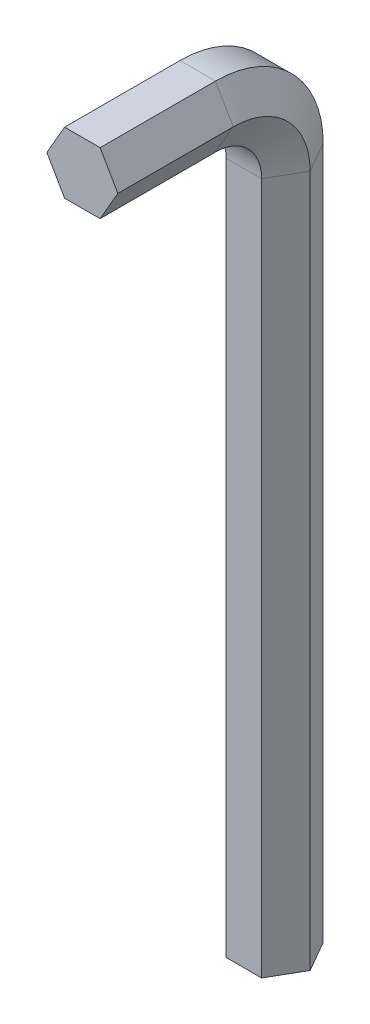
ISO-10303-21;
HEADER;
FILE_DESCRIPTION(('STEP AP214'),'2;1');
FILE_NAME('part.step','',(''),(''),'','','');
FILE_SCHEMA(('AUTOMOTIVE_DESIGN { 1 0 10303 214 1 1 1 1 }'));
ENDSEC;
DATA;
#1=APPLICATION_CONTEXT('core data for automotive mechanical design processes');
#2=APPLICATION_PROTOCOL_DEFINITION('international standard','automotive_design',2000,#1);
#3=PRODUCT_CONTEXT('',#1,'mechanical');
#4=PRODUCT('Part','Part','',(#3));
#5=PRODUCT_RELATED_PRODUCT_CATEGORY('part','',(#4));
#6=PRODUCT_DEFINITION_FORMATION('','',#4);
#7=PRODUCT_DEFINITION_CONTEXT('part definition',#1,'design');
#8=PRODUCT_DEFINITION('design','',#6,#7);
#9=PRODUCT_DEFINITION_SHAPE('','',#8);
#10=(LENGTH_UNIT() NAMED_UNIT(*) SI_UNIT(.MILLI.,.METRE.));
#11=(NAMED_UNIT(*) PLANE_ANGLE_UNIT() SI_UNIT($,.RADIAN.));
#12=(NAMED_UNIT(*) SI_UNIT($,.STERADIAN.) SOLID_ANGLE_UNIT());
#13=UNCERTAINTY_MEASURE_WITH_UNIT(LENGTH_MEASURE(1.E-05),#10,'distance_accuracy_value','');
#14=(GEOMETRIC_REPRESENTATION_CONTEXT(3) GLOBAL_UNCERTAINTY_ASSIGNED_CONTEXT((#13)) GLOBAL_UNIT_ASSIGNED_CONTEXT((#10,
#11,#12)) REPRESENTATION_CONTEXT('',''));
#15=CARTESIAN_POINT('',(0.,0.,0.));
#16=DIRECTION('',(0.,0.,1.));
#17=DIRECTION('',(1.,0.,0.));
#18=AXIS2_PLACEMENT_3D('',#15,#16,#17);
#19=CARTESIAN_POINT('',(0.,0.,0.));
#20=DIRECTION('',(0.,1.,0.));
#21=DIRECTION('',(0.,0.,1.));
#22=AXIS2_PLACEMENT_3D('',#19,#20,#21);
#23=PLANE('',#22);
#24=DIRECTION('',(1.,0.,0.));
#25=VECTOR('',#24,1.);
#26=CARTESIAN_POINT('',(-2.3094010767585,0.,4.));
#27=LINE('',#26,#25);
#28=CARTESIAN_POINT('',(-2.3094010767585,0.,4.));
#29=VERTEX_POINT('',#28);
#30=CARTESIAN_POINT('',(2.3094010767585,0.,4.));
#31=VERTEX_POINT('',#30);
#32=EDGE_CURVE('E184',#29,#31,#27,.T.);
#33=ORIENTED_EDGE('',*,*,#32,.F.);
#34=DIRECTION('',(0.5,0.,0.866025403784439));
#35=VECTOR('',#34,1.);
#36=CARTESIAN_POINT('',(-4.618802153517,0.,0.));
#37=LINE('',#36,#35);
#38=CARTESIAN_POINT('',(-4.618802153517,0.,0.));
#39=VERTEX_POINT('',#38);
#40=EDGE_CURVE('E226',#39,#29,#37,.T.);
#41=ORIENTED_EDGE('',*,*,#40,.F.);
#42=DIRECTION('',(-0.5,0.,0.866025403784439));
#43=VECTOR('',#42,1.);
#44=CARTESIAN_POINT('',(-2.3094010767585,0.,-4.));
#45=LINE('',#44,#43);
#46=CARTESIAN_POINT('',(-2.3094010767585,0.,-4.));
#47=VERTEX_POINT('',#46);
#48=EDGE_CURVE('E213',#47,#39,#45,.T.);
#49=ORIENTED_EDGE('',*,*,#48,.F.);
#50=DIRECTION('',(-1.,0.,0.));
#51=VECTOR('',#50,1.);
#52=CARTESIAN_POINT('',(2.3094010767585,0.,-4.));
#53=LINE('',#52,#51);
#54=CARTESIAN_POINT('',(2.3094010767585,0.,-4.));
#55=VERTEX_POINT('',#54);
#56=EDGE_CURVE('E136',#55,#47,#53,.T.);
#57=ORIENTED_EDGE('',*,*,#56,.F.);
#58=DIRECTION('',(-0.5,0.,-0.866025403784438));
#59=VECTOR('',#58,1.);
#60=CARTESIAN_POINT('',(4.61880215351701,0.,0.));
#61=LINE('',#60,#59);
#62=CARTESIAN_POINT('',(4.61880215351701,0.,0.));
#63=VERTEX_POINT('',#62);
#64=EDGE_CURVE('E140',#63,#55,#61,.T.);
#65=ORIENTED_EDGE('',*,*,#64,.F.);
#66=DIRECTION('',(0.5,0.,-0.866025403784439));
#67=VECTOR('',#66,1.);
#68=CARTESIAN_POINT('',(2.3094010767585,0.,4.));
#69=LINE('',#68,#67);
#70=EDGE_CURVE('E145',#31,#63,#69,.T.);
#71=ORIENTED_EDGE('',*,*,#70,.F.);
#72=EDGE_LOOP('',(#33,#41,#49,#57,#65,#71));
#73=FACE_BOUND('',#72,.T.);
#74=ADVANCED_FACE('F35',(#73),#23,.F.);
#75=CARTESIAN_POINT('',(0.,100.,25.));
#76=DIRECTION('',(0.,0.,1.));
#77=DIRECTION('',(0.,-1.,0.));
#78=AXIS2_PLACEMENT_3D('',#75,#76,#77);
#79=PLANE('',#78);
#80=DIRECTION('',(1.,0.,0.));
#81=VECTOR('',#80,1.);
#82=CARTESIAN_POINT('',(-2.3094010767585,96.,25.));
#83=LINE('',#82,#81);
#84=CARTESIAN_POINT('',(-2.3094010767585,96.,25.));
#85=VERTEX_POINT('',#84);
#86=CARTESIAN_POINT('',(2.3094010767585,96.,25.));
#87=VERTEX_POINT('',#86);
#88=EDGE_CURVE('E156',#85,#87,#83,.T.);
#89=ORIENTED_EDGE('',*,*,#88,.T.);
#90=DIRECTION('',(0.5,0.866025403784439,0.));
#91=VECTOR('',#90,1.);
#92=CARTESIAN_POINT('',(2.3094010767585,96.,25.));
#93=LINE('',#92,#91);
#94=CARTESIAN_POINT('',(4.61880215351701,100.,25.));
#95=VERTEX_POINT('',#94);
#96=EDGE_CURVE('E159',#87,#95,#93,.T.);
#97=ORIENTED_EDGE('',*,*,#96,.T.);
#98=DIRECTION('',(-0.5,0.866025403784438,0.));
#99=VECTOR('',#98,1.);
#100=CARTESIAN_POINT('',(4.61880215351701,100.,25.));
#101=LINE('',#100,#99);
#102=CARTESIAN_POINT('',(2.3094010767585,104.,25.));
#103=VERTEX_POINT('',#102);
#104=EDGE_CURVE('E199',#95,#103,#101,.T.);
#105=ORIENTED_EDGE('',*,*,#104,.T.);
#106=DIRECTION('',(-1.,0.,0.));
#107=VECTOR('',#106,1.);
#108=CARTESIAN_POINT('',(2.3094010767585,104.,25.));
#109=LINE('',#108,#107);
#110=CARTESIAN_POINT('',(-2.3094010767585,104.,25.));
#111=VERTEX_POINT('',#110);
#112=EDGE_CURVE('E54',#103,#111,#109,.T.);
#113=ORIENTED_EDGE('',*,*,#112,.T.);
#114=DIRECTION('',(-0.5,-0.866025403784439,0.));
#115=VECTOR('',#114,1.);
#116=CARTESIAN_POINT('',(-2.3094010767585,104.,25.));
#117=LINE('',#116,#115);
#118=CARTESIAN_POINT('',(-4.618802153517,100.,25.));
#119=VERTEX_POINT('',#118);
#120=EDGE_CURVE('E48',#111,#119,#117,.T.);
#121=ORIENTED_EDGE('',*,*,#120,.T.);
#122=DIRECTION('',(0.5,-0.866025403784439,0.));
#123=VECTOR('',#122,1.);
#124=CARTESIAN_POINT('',(-4.618802153517,100.,25.));
#125=LINE('',#124,#123);
#126=EDGE_CURVE('E11',#119,#85,#125,.T.);
#127=ORIENTED_EDGE('',*,*,#126,.T.);
#128=EDGE_LOOP('',(#89,#97,#105,#113,#121,#127));
#129=FACE_BOUND('',#128,.T.);
#130=ADVANCED_FACE('F158',(#129),#79,.T.);
#131=CARTESIAN_POINT('',(-2.3094010767585,0.,4.));
#132=DIRECTION('',(0.,0.,1.));
#133=DIRECTION('',(0.,-1.,0.));
#134=AXIS2_PLACEMENT_3D('',#131,#132,#133);
#135=PLANE('',#134);
#136=DIRECTION('',(0.,1.,0.));
#137=VECTOR('',#136,1.);
#138=CARTESIAN_POINT('',(2.3094010767585,0.,4.));
#139=LINE('',#138,#137);
#140=CARTESIAN_POINT('',(2.3094010767585,90.,4.));
#141=VERTEX_POINT('',#140);
#142=EDGE_CURVE('E189',#31,#141,#139,.T.);
#143=ORIENTED_EDGE('',*,*,#142,.T.);
#144=DIRECTION('',(1.,0.,0.));
#145=VECTOR('',#144,1.);
#146=CARTESIAN_POINT('',(-2.3094010767585,90.,4.));
#147=LINE('',#146,#145);
#148=CARTESIAN_POINT('',(-2.3094010767585,90.,4.));
#149=VERTEX_POINT('',#148);
#150=EDGE_CURVE('E258',#149,#141,#147,.T.);
#151=ORIENTED_EDGE('',*,*,#150,.F.);
#152=DIRECTION('',(0.,1.,0.));
#153=VECTOR('',#152,1.);
#154=CARTESIAN_POINT('',(-2.3094010767585,0.,4.));
#155=LINE('',#154,#153);
#156=EDGE_CURVE('E240',#29,#149,#155,.T.);
#157=ORIENTED_EDGE('',*,*,#156,.F.);
#158=ORIENTED_EDGE('',*,*,#32,.T.);
#159=EDGE_LOOP('',(#143,#151,#157,#158));
#160=FACE_BOUND('',#159,.T.);
#161=ADVANCED_FACE('F265',(#160),#135,.T.);
#162=CARTESIAN_POINT('',(2.3094010767585,0.,4.));
#163=DIRECTION('',(0.866025403784439,0.,0.5));
#164=DIRECTION('',(0.5,0.,-0.866025403784439));
#165=AXIS2_PLACEMENT_3D('',#162,#163,#164);
#166=PLANE('',#165);
#167=DIRECTION('',(0.,1.,0.));
#168=VECTOR('',#167,1.);
#169=CARTESIAN_POINT('',(4.61880215351701,0.,0.));
#170=LINE('',#169,#168);
#171=CARTESIAN_POINT('',(4.61880215351701,90.,0.));
#172=VERTEX_POINT('',#171);
#173=EDGE_CURVE('E188',#63,#172,#170,.T.);
#174=ORIENTED_EDGE('',*,*,#173,.T.);
#175=DIRECTION('',(0.5,0.,-0.866025403784439));
#176=VECTOR('',#175,1.);
#177=CARTESIAN_POINT('',(2.3094010767585,90.,4.));
#178=LINE('',#177,#176);
#179=EDGE_CURVE('E185',#141,#172,#178,.T.);
#180=ORIENTED_EDGE('',*,*,#179,.F.);
#181=ORIENTED_EDGE('',*,*,#142,.F.);
#182=ORIENTED_EDGE('',*,*,#70,.T.);
#183=EDGE_LOOP('',(#174,#180,#181,#182));
#184=FACE_BOUND('',#183,.T.);
#185=ADVANCED_FACE('F268',(#184),#166,.T.);
#186=CARTESIAN_POINT('',(4.61880215351701,0.,0.));
#187=DIRECTION('',(0.866025403784438,0.,-0.5));
#188=DIRECTION('',(-0.5,0.,-0.866025403784439));
#189=AXIS2_PLACEMENT_3D('',#186,#187,#188);
#190=PLANE('',#189);
#191=DIRECTION('',(0.,1.,0.));
#192=VECTOR('',#191,1.);
#193=CARTESIAN_POINT('',(2.3094010767585,0.,-4.));
#194=LINE('',#193,#192);
#195=CARTESIAN_POINT('',(2.3094010767585,90.,-4.));
#196=VERTEX_POINT('',#195);
#197=EDGE_CURVE('E202',#55,#196,#194,.T.);
#198=ORIENTED_EDGE('',*,*,#197,.T.);
#199=DIRECTION('',(-0.5,0.,-0.866025403784438));
#200=VECTOR('',#199,1.);
#201=CARTESIAN_POINT('',(4.61880215351701,90.,0.));
#202=LINE('',#201,#200);
#203=EDGE_CURVE('E192',#172,#196,#202,.T.);
#204=ORIENTED_EDGE('',*,*,#203,.F.);
#205=ORIENTED_EDGE('',*,*,#173,.F.);
#206=ORIENTED_EDGE('',*,*,#64,.T.);
#207=EDGE_LOOP('',(#198,#204,#205,#206));
#208=FACE_BOUND('',#207,.T.);
#209=ADVANCED_FACE('F322',(#208),#190,.T.);
#210=CARTESIAN_POINT('',(2.3094010767585,0.,-4.));
#211=DIRECTION('',(0.,0.,-1.));
#212=DIRECTION('',(0.,1.,0.));
#213=AXIS2_PLACEMENT_3D('',#210,#211,#212);
#214=PLANE('',#213);
#215=DIRECTION('',(0.,1.,0.));
#216=VECTOR('',#215,1.);
#217=CARTESIAN_POINT('',(-2.3094010767585,0.,-4.));
#218=LINE('',#217,#216);
#219=CARTESIAN_POINT('',(-2.3094010767585,90.,-4.));
#220=VERTEX_POINT('',#219);
#221=EDGE_CURVE('E215',#47,#220,#218,.T.);
#222=ORIENTED_EDGE('',*,*,#221,.T.);
#223=DIRECTION('',(-1.,0.,0.));
#224=VECTOR('',#223,1.);
#225=CARTESIAN_POINT('',(2.3094010767585,90.,-4.));
#226=LINE('',#225,#224);
#227=EDGE_CURVE('E205',#196,#220,#226,.T.);
#228=ORIENTED_EDGE('',*,*,#227,.F.);
#229=ORIENTED_EDGE('',*,*,#197,.F.);
#230=ORIENTED_EDGE('',*,*,#56,.T.);
#231=EDGE_LOOP('',(#222,#228,#229,#230));
#232=FACE_BOUND('',#231,.T.);
#233=ADVANCED_FACE('F330',(#232),#214,.T.);
#234=CARTESIAN_POINT('',(-2.3094010767585,0.,-4.));
#235=DIRECTION('',(-0.866025403784439,0.,-0.5));
#236=DIRECTION('',(-0.5,0.,0.866025403784439));
#237=AXIS2_PLACEMENT_3D('',#234,#235,#236);
#238=PLANE('',#237);
#239=DIRECTION('',(0.,1.,0.));
#240=VECTOR('',#239,1.);
#241=CARTESIAN_POINT('',(-4.618802153517,0.,0.));
#242=LINE('',#241,#240);
#243=CARTESIAN_POINT('',(-4.618802153517,90.,0.));
#244=VERTEX_POINT('',#243);
#245=EDGE_CURVE('E228',#39,#244,#242,.T.);
#246=ORIENTED_EDGE('',*,*,#245,.T.);
#247=DIRECTION('',(-0.5,0.,0.866025403784439));
#248=VECTOR('',#247,1.);
#249=CARTESIAN_POINT('',(-2.3094010767585,90.,-4.));
#250=LINE('',#249,#248);
#251=EDGE_CURVE('E218',#220,#244,#250,.T.);
#252=ORIENTED_EDGE('',*,*,#251,.F.);
#253=ORIENTED_EDGE('',*,*,#221,.F.);
#254=ORIENTED_EDGE('',*,*,#48,.T.);
#255=EDGE_LOOP('',(#246,#252,#253,#254));
#256=FACE_BOUND('',#255,.T.);
#257=ADVANCED_FACE('F340',(#256),#238,.T.);
#258=CARTESIAN_POINT('',(-4.618802153517,0.,0.));
#259=DIRECTION('',(-0.866025403784439,0.,0.5));
#260=DIRECTION('',(0.5,0.,0.866025403784439));
#261=AXIS2_PLACEMENT_3D('',#258,#259,#260);
#262=PLANE('',#261);
#263=DIRECTION('',(0.5,0.,0.866025403784439));
#264=VECTOR('',#263,1.);
#265=CARTESIAN_POINT('',(-4.618802153517,90.,0.));
#266=LINE('',#265,#264);
#267=EDGE_CURVE('E231',#244,#149,#266,.T.);
#268=ORIENTED_EDGE('',*,*,#267,.F.);
#269=ORIENTED_EDGE('',*,*,#245,.F.);
#270=ORIENTED_EDGE('',*,*,#40,.T.);
#271=ORIENTED_EDGE('',*,*,#156,.T.);
#272=EDGE_LOOP('',(#268,#269,#270,#271));
#273=FACE_BOUND('',#272,.T.);
#274=ADVANCED_FACE('F281',(#273),#262,.T.);
#275=CARTESIAN_POINT('',(0.,90.,10.));
#276=DIRECTION('',(1.,0.,0.));
#277=DIRECTION('',(0.,0.,-1.));
#278=AXIS2_PLACEMENT_3D('',#275,#276,#277);
#279=CYLINDRICAL_SURFACE('',#278,6.);
#280=CARTESIAN_POINT('',(2.3094010767585,90.,10.));
#281=DIRECTION('',(1.,0.,0.));
#282=DIRECTION('',(0.,0.,-1.));
#283=AXIS2_PLACEMENT_3D('',#280,#281,#282);
#284=CIRCLE('',#283,6.);
#285=CARTESIAN_POINT('',(2.3094010767585,96.,10.));
#286=VERTEX_POINT('',#285);
#287=EDGE_CURVE('E195',#141,#286,#284,.T.);
#288=ORIENTED_EDGE('',*,*,#287,.T.);
#289=DIRECTION('',(1.,0.,0.));
#290=VECTOR('',#289,1.);
#291=CARTESIAN_POINT('',(-2.3094010767585,96.,10.));
#292=LINE('',#291,#290);
#293=CARTESIAN_POINT('',(-2.3094010767585,96.,10.));
#294=VERTEX_POINT('',#293);
#295=EDGE_CURVE('E177',#294,#286,#292,.T.);
#296=ORIENTED_EDGE('',*,*,#295,.F.);
#297=CARTESIAN_POINT('',(-2.3094010767585,90.,10.));
#298=DIRECTION('',(1.,0.,0.));
#299=DIRECTION('',(0.,0.,-1.));
#300=AXIS2_PLACEMENT_3D('',#297,#298,#299);
#301=CIRCLE('',#300,6.);
#302=EDGE_CURVE('E242',#149,#294,#301,.T.);
#303=ORIENTED_EDGE('',*,*,#302,.F.);
#304=ORIENTED_EDGE('',*,*,#150,.T.);
#305=EDGE_LOOP('',(#288,#296,#303,#304));
#306=FACE_BOUND('',#305,.T.);
#307=ADVANCED_FACE('F248',(#306),#279,.F.);
#308=CARTESIAN_POINT('',(2.3094010767585,90.,10.));
#309=DIRECTION('',(1.,0.,0.));
#310=DIRECTION('',(0.,0.,-1.));
#311=AXIS2_PLACEMENT_3D('',#308,#309,#310);
#312=CONICAL_SURFACE('',#311,6.,1.0471975511966);
#313=CARTESIAN_POINT('',(4.61880215351701,90.,10.));
#314=DIRECTION('',(1.,0.,0.));
#315=DIRECTION('',(0.,0.,-1.));
#316=AXIS2_PLACEMENT_3D('',#313,#314,#315);
#317=CIRCLE('',#316,10.);
#318=CARTESIAN_POINT('',(4.61880215351701,100.,10.));
#319=VERTEX_POINT('',#318);
#320=EDGE_CURVE('E123',#172,#319,#317,.T.);
#321=ORIENTED_EDGE('',*,*,#320,.T.);
#322=DIRECTION('',(0.5,0.866025403784439,0.));
#323=VECTOR('',#322,1.);
#324=CARTESIAN_POINT('',(2.3094010767585,96.,10.));
#325=LINE('',#324,#323);
#326=EDGE_CURVE('E193',#286,#319,#325,.T.);
#327=ORIENTED_EDGE('',*,*,#326,.F.);
#328=ORIENTED_EDGE('',*,*,#287,.F.);
#329=ORIENTED_EDGE('',*,*,#179,.T.);
#330=EDGE_LOOP('',(#321,#327,#328,#329));
#331=FACE_BOUND('',#330,.T.);
#332=ADVANCED_FACE('F271',(#331),#312,.F.);
#333=CARTESIAN_POINT('',(4.61880215351701,90.,10.));
#334=DIRECTION('',(-1.,0.,0.));
#335=DIRECTION('',(0.,0.,1.));
#336=AXIS2_PLACEMENT_3D('',#333,#334,#335);
#337=CONICAL_SURFACE('',#336,10.,1.0471975511966);
#338=CARTESIAN_POINT('',(2.3094010767585,90.,10.));
#339=DIRECTION('',(1.,0.,0.));
#340=DIRECTION('',(0.,0.,-1.));
#341=AXIS2_PLACEMENT_3D('',#338,#339,#340);
#342=CIRCLE('',#341,14.);
#343=CARTESIAN_POINT('',(2.3094010767585,104.,10.));
#344=VERTEX_POINT('',#343);
#345=EDGE_CURVE('E114',#196,#344,#342,.T.);
#346=ORIENTED_EDGE('',*,*,#345,.T.);
#347=DIRECTION('',(-0.5,0.866025403784438,0.));
#348=VECTOR('',#347,1.);
#349=CARTESIAN_POINT('',(4.61880215351701,100.,10.));
#350=LINE('',#349,#348);
#351=EDGE_CURVE('E196',#319,#344,#350,.T.);
#352=ORIENTED_EDGE('',*,*,#351,.F.);
#353=ORIENTED_EDGE('',*,*,#320,.F.);
#354=ORIENTED_EDGE('',*,*,#203,.T.);
#355=EDGE_LOOP('',(#346,#352,#353,#354));
#356=FACE_BOUND('',#355,.T.);
#357=ADVANCED_FACE('F273',(#356),#337,.T.);
#358=CARTESIAN_POINT('',(0.,90.,10.));
#359=DIRECTION('',(1.,0.,0.));
#360=DIRECTION('',(0.,0.,-1.));
#361=AXIS2_PLACEMENT_3D('',#358,#359,#360);
#362=CYLINDRICAL_SURFACE('',#361,14.);
#363=CARTESIAN_POINT('',(-2.3094010767585,90.,10.));
#364=DIRECTION('',(1.,0.,0.));
#365=DIRECTION('',(0.,0.,-1.));
#366=AXIS2_PLACEMENT_3D('',#363,#364,#365);
#367=CIRCLE('',#366,14.);
#368=CARTESIAN_POINT('',(-2.3094010767585,104.,10.));
#369=VERTEX_POINT('',#368);
#370=EDGE_CURVE('E107',#220,#369,#367,.T.);
#371=ORIENTED_EDGE('',*,*,#370,.T.);
#372=DIRECTION('',(-1.,0.,0.));
#373=VECTOR('',#372,1.);
#374=CARTESIAN_POINT('',(2.3094010767585,104.,10.));
#375=LINE('',#374,#373);
#376=EDGE_CURVE('E209',#344,#369,#375,.T.);
#377=ORIENTED_EDGE('',*,*,#376,.F.);
#378=ORIENTED_EDGE('',*,*,#345,.F.);
#379=ORIENTED_EDGE('',*,*,#227,.T.);
#380=EDGE_LOOP('',(#371,#377,#378,#379));
#381=FACE_BOUND('',#380,.T.);
#382=ADVANCED_FACE('F279',(#381),#362,.T.);
#383=CARTESIAN_POINT('',(-2.3094010767585,90.,10.));
#384=DIRECTION('',(1.,0.,0.));
#385=DIRECTION('',(0.,0.,-1.));
#386=AXIS2_PLACEMENT_3D('',#383,#384,#385);
#387=CONICAL_SURFACE('',#386,14.,1.0471975511966);
#388=CARTESIAN_POINT('',(-4.618802153517,90.,10.));
#389=DIRECTION('',(1.,0.,0.));
#390=DIRECTION('',(0.,0.,-1.));
#391=AXIS2_PLACEMENT_3D('',#388,#389,#390);
#392=CIRCLE('',#391,10.);
#393=CARTESIAN_POINT('',(-4.618802153517,100.,10.));
#394=VERTEX_POINT('',#393);
#395=EDGE_CURVE('E233',#244,#394,#392,.T.);
#396=ORIENTED_EDGE('',*,*,#395,.T.);
#397=DIRECTION('',(-0.5,-0.866025403784439,0.));
#398=VECTOR('',#397,1.);
#399=CARTESIAN_POINT('',(-2.3094010767585,104.,10.));
#400=LINE('',#399,#398);
#401=EDGE_CURVE('E221',#369,#394,#400,.T.);
#402=ORIENTED_EDGE('',*,*,#401,.F.);
#403=ORIENTED_EDGE('',*,*,#370,.F.);
#404=ORIENTED_EDGE('',*,*,#251,.T.);
#405=EDGE_LOOP('',(#396,#402,#403,#404));
#406=FACE_BOUND('',#405,.T.);
#407=ADVANCED_FACE('F383',(#406),#387,.T.);
#408=CARTESIAN_POINT('',(-4.618802153517,90.,10.));
#409=DIRECTION('',(-1.,0.,0.));
#410=DIRECTION('',(0.,0.,1.));
#411=AXIS2_PLACEMENT_3D('',#408,#409,#410);
#412=CONICAL_SURFACE('',#411,10.,1.0471975511966);
#413=DIRECTION('',(0.5,-0.866025403784439,0.));
#414=VECTOR('',#413,1.);
#415=CARTESIAN_POINT('',(-4.618802153517,100.,10.));
#416=LINE('',#415,#414);
#417=EDGE_CURVE('E182',#394,#294,#416,.T.);
#418=ORIENTED_EDGE('',*,*,#417,.F.);
#419=ORIENTED_EDGE('',*,*,#395,.F.);
#420=ORIENTED_EDGE('',*,*,#267,.T.);
#421=ORIENTED_EDGE('',*,*,#302,.T.);
#422=EDGE_LOOP('',(#418,#419,#420,#421));
#423=FACE_BOUND('',#422,.T.);
#424=ADVANCED_FACE('F251',(#423),#412,.F.);
#425=CARTESIAN_POINT('',(-2.3094010767585,96.,10.));
#426=DIRECTION('',(0.,-1.,0.));
#427=DIRECTION('',(0.,0.,-1.));
#428=AXIS2_PLACEMENT_3D('',#425,#426,#427);
#429=PLANE('',#428);
#430=DIRECTION('',(0.,0.,1.));
#431=VECTOR('',#430,1.);
#432=CARTESIAN_POINT('',(2.3094010767585,96.,10.));
#433=LINE('',#432,#431);
#434=EDGE_CURVE('E164',#286,#87,#433,.T.);
#435=ORIENTED_EDGE('',*,*,#434,.T.);
#436=ORIENTED_EDGE('',*,*,#88,.F.);
#437=DIRECTION('',(0.,0.,1.));
#438=VECTOR('',#437,1.);
#439=CARTESIAN_POINT('',(-2.3094010767585,96.,10.));
#440=LINE('',#439,#438);
#441=EDGE_CURVE('E165',#294,#85,#440,.T.);
#442=ORIENTED_EDGE('',*,*,#441,.F.);
#443=ORIENTED_EDGE('',*,*,#295,.T.);
#444=EDGE_LOOP('',(#435,#436,#442,#443));
#445=FACE_BOUND('',#444,.T.);
#446=ADVANCED_FACE('F175',(#445),#429,.T.);
#447=CARTESIAN_POINT('',(2.3094010767585,96.,10.));
#448=DIRECTION('',(0.866025403784438,-0.5,0.));
#449=DIRECTION('',(0.5,0.866025403784439,0.));
#450=AXIS2_PLACEMENT_3D('',#447,#448,#449);
#451=PLANE('',#450);
#452=DIRECTION('',(0.,0.,1.));
#453=VECTOR('',#452,1.);
#454=CARTESIAN_POINT('',(4.61880215351701,100.,10.));
#455=LINE('',#454,#453);
#456=EDGE_CURVE('E172',#319,#95,#455,.T.);
#457=ORIENTED_EDGE('',*,*,#456,.T.);
#458=ORIENTED_EDGE('',*,*,#96,.F.);
#459=ORIENTED_EDGE('',*,*,#434,.F.);
#460=ORIENTED_EDGE('',*,*,#326,.T.);
#461=EDGE_LOOP('',(#457,#458,#459,#460));
#462=FACE_BOUND('',#461,.T.);
#463=ADVANCED_FACE('F169',(#462),#451,.T.);
#464=CARTESIAN_POINT('',(4.61880215351701,100.,10.));
#465=DIRECTION('',(0.866025403784438,0.5,0.));
#466=DIRECTION('',(-0.5,0.866025403784439,0.));
#467=AXIS2_PLACEMENT_3D('',#464,#465,#466);
#468=PLANE('',#467);
#469=DIRECTION('',(0.,0.,1.));
#470=VECTOR('',#469,1.);
#471=CARTESIAN_POINT('',(2.3094010767585,104.,10.));
#472=LINE('',#471,#470);
#473=EDGE_CURVE('E92',#344,#103,#472,.T.);
#474=ORIENTED_EDGE('',*,*,#473,.T.);
#475=ORIENTED_EDGE('',*,*,#104,.F.);
#476=ORIENTED_EDGE('',*,*,#456,.F.);
#477=ORIENTED_EDGE('',*,*,#351,.T.);
#478=EDGE_LOOP('',(#474,#475,#476,#477));
#479=FACE_BOUND('',#478,.T.);
#480=ADVANCED_FACE('F415',(#479),#468,.T.);
#481=CARTESIAN_POINT('',(2.3094010767585,104.,10.));
#482=DIRECTION('',(0.,1.,0.));
#483=DIRECTION('',(0.,0.,1.));
#484=AXIS2_PLACEMENT_3D('',#481,#482,#483);
#485=PLANE('',#484);
#486=DIRECTION('',(0.,0.,1.));
#487=VECTOR('',#486,1.);
#488=CARTESIAN_POINT('',(-2.3094010767585,104.,10.));
#489=LINE('',#488,#487);
#490=EDGE_CURVE('E84',#369,#111,#489,.T.);
#491=ORIENTED_EDGE('',*,*,#490,.T.);
#492=ORIENTED_EDGE('',*,*,#112,.F.);
#493=ORIENTED_EDGE('',*,*,#473,.F.);
#494=ORIENTED_EDGE('',*,*,#376,.T.);
#495=EDGE_LOOP('',(#491,#492,#493,#494));
#496=FACE_BOUND('',#495,.T.);
#497=ADVANCED_FACE('F291',(#496),#485,.T.);
#498=CARTESIAN_POINT('',(-2.3094010767585,104.,10.));
#499=DIRECTION('',(-0.866025403784439,0.5,0.));
#500=DIRECTION('',(-0.5,-0.866025403784439,0.));
#501=AXIS2_PLACEMENT_3D('',#498,#499,#500);
#502=PLANE('',#501);
#503=DIRECTION('',(0.,0.,1.));
#504=VECTOR('',#503,1.);
#505=CARTESIAN_POINT('',(-4.618802153517,100.,10.));
#506=LINE('',#505,#504);
#507=EDGE_CURVE('E42',#394,#119,#506,.T.);
#508=ORIENTED_EDGE('',*,*,#507,.T.);
#509=ORIENTED_EDGE('',*,*,#120,.F.);
#510=ORIENTED_EDGE('',*,*,#490,.F.);
#511=ORIENTED_EDGE('',*,*,#401,.T.);
#512=EDGE_LOOP('',(#508,#509,#510,#511));
#513=FACE_BOUND('',#512,.T.);
#514=ADVANCED_FACE('F286',(#513),#502,.T.);
#515=CARTESIAN_POINT('',(-4.618802153517,100.,10.));
#516=DIRECTION('',(-0.866025403784439,-0.5,0.));
#517=DIRECTION('',(0.5,-0.866025403784439,0.));
#518=AXIS2_PLACEMENT_3D('',#515,#516,#517);
#519=PLANE('',#518);
#520=ORIENTED_EDGE('',*,*,#126,.F.);
#521=ORIENTED_EDGE('',*,*,#507,.F.);
#522=ORIENTED_EDGE('',*,*,#417,.T.);
#523=ORIENTED_EDGE('',*,*,#441,.T.);
#524=EDGE_LOOP('',(#520,#521,#522,#523));
#525=FACE_BOUND('',#524,.T.);
#526=ADVANCED_FACE('F243',(#525),#519,.T.);
#527=CLOSED_SHELL('',(#74,#130,#161,#185,#209,#233,#257,#274,#307,#332,#357,#382,#407,#424,#446,
#463,#480,#497,#514,#526));
#528=MANIFOLD_SOLID_BREP('B2',#527);
#529=ADVANCED_BREP_SHAPE_REPRESENTATION('',(#18,#528),#14);
#530=SHAPE_DEFINITION_REPRESENTATION(#9,#529);
ENDSEC;
END-ISO-10303-21;
